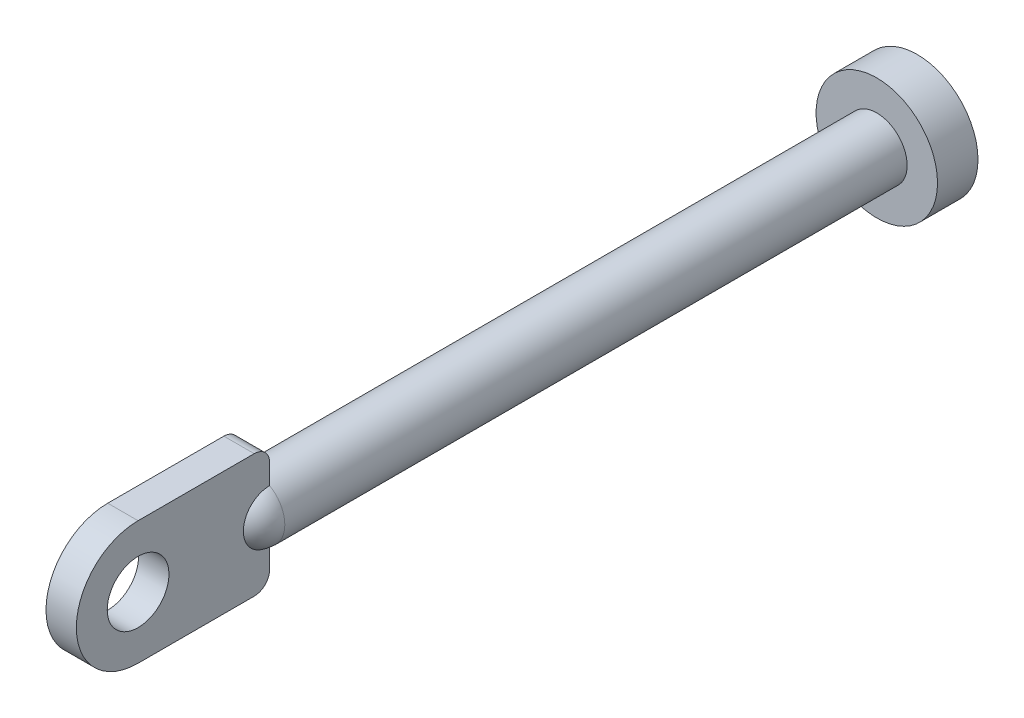
ISO-10303-21;
HEADER;
FILE_DESCRIPTION(('STEP AP214'),'2;1');
FILE_NAME('part.step','',(''),(''),'','','');
FILE_SCHEMA(('AUTOMOTIVE_DESIGN { 1 0 10303 214 1 1 1 1 }'));
ENDSEC;
DATA;
#1=APPLICATION_CONTEXT('core data for automotive mechanical design processes');
#2=APPLICATION_PROTOCOL_DEFINITION('international standard','automotive_design',2000,#1);
#3=PRODUCT_CONTEXT('',#1,'mechanical');
#4=PRODUCT('Part','Part','',(#3));
#5=PRODUCT_RELATED_PRODUCT_CATEGORY('part','',(#4));
#6=PRODUCT_DEFINITION_FORMATION('','',#4);
#7=PRODUCT_DEFINITION_CONTEXT('part definition',#1,'design');
#8=PRODUCT_DEFINITION('design','',#6,#7);
#9=PRODUCT_DEFINITION_SHAPE('','',#8);
#10=(LENGTH_UNIT() NAMED_UNIT(*) SI_UNIT(.MILLI.,.METRE.));
#11=(NAMED_UNIT(*) PLANE_ANGLE_UNIT() SI_UNIT($,.RADIAN.));
#12=(NAMED_UNIT(*) SI_UNIT($,.STERADIAN.) SOLID_ANGLE_UNIT());
#13=UNCERTAINTY_MEASURE_WITH_UNIT(LENGTH_MEASURE(1.E-05),#10,'distance_accuracy_value','');
#14=(GEOMETRIC_REPRESENTATION_CONTEXT(3) GLOBAL_UNCERTAINTY_ASSIGNED_CONTEXT((#13)) GLOBAL_UNIT_ASSIGNED_CONTEXT((#10,
#11,#12)) REPRESENTATION_CONTEXT('',''));
#15=CARTESIAN_POINT('',(0.,0.,0.));
#16=DIRECTION('',(0.,0.,1.));
#17=DIRECTION('',(1.,0.,0.));
#18=AXIS2_PLACEMENT_3D('',#15,#16,#17);
#19=CARTESIAN_POINT('',(0.,0.,40.));
#20=DIRECTION('',(0.,0.,1.));
#21=DIRECTION('',(0.,1.,0.));
#22=AXIS2_PLACEMENT_3D('',#19,#20,#21);
#23=SPHERICAL_SURFACE('',#22,3.);
#24=CARTESIAN_POINT('',(1.5,0.,40.));
#25=DIRECTION('',(-1.,0.,0.));
#26=DIRECTION('',(0.,0.,1.));
#27=AXIS2_PLACEMENT_3D('',#24,#25,#26);
#28=CIRCLE('',#27,2.59807621135332);
#29=CARTESIAN_POINT('',(1.5,-2.59807621135332,40.));
#30=VERTEX_POINT('',#29);
#31=CARTESIAN_POINT('',(1.5,2.59807621135332,40.));
#32=VERTEX_POINT('',#31);
#33=EDGE_CURVE('E24',#30,#32,#28,.T.);
#34=ORIENTED_EDGE('',*,*,#33,.F.);
#35=CARTESIAN_POINT('',(0.,0.,40.));
#36=DIRECTION('',(0.,0.,1.));
#37=DIRECTION('',(1.,0.,0.));
#38=AXIS2_PLACEMENT_3D('',#35,#36,#37);
#39=CIRCLE('',#38,3.);
#40=EDGE_CURVE('E151',#30,#32,#39,.T.);
#41=ORIENTED_EDGE('',*,*,#40,.T.);
#42=EDGE_LOOP('',(#34,#41));
#43=FACE_BOUND('',#42,.T.);
#44=ADVANCED_FACE('F15',(#43),#23,.T.);
#45=CARTESIAN_POINT('',(-1.5,2.59807621135332,40.));
#46=VERTEX_POINT('',#45);
#47=CARTESIAN_POINT('',(-1.5,-2.59807621135332,40.));
#48=VERTEX_POINT('',#47);
#49=EDGE_CURVE('E173',#46,#48,#39,.T.);
#50=ORIENTED_EDGE('',*,*,#49,.T.);
#51=CARTESIAN_POINT('',(-1.5,0.,40.));
#52=DIRECTION('',(-1.,0.,0.));
#53=DIRECTION('',(0.,0.,1.));
#54=AXIS2_PLACEMENT_3D('',#51,#52,#53);
#55=CIRCLE('',#54,2.59807621135332);
#56=EDGE_CURVE('E10',#48,#46,#55,.T.);
#57=ORIENTED_EDGE('',*,*,#56,.T.);
#58=EDGE_LOOP('',(#50,#57));
#59=FACE_BOUND('',#58,.T.);
#60=ADVANCED_FACE('F17',(#59),#23,.T.);
#61=CARTESIAN_POINT('',(0.,0.,-25.5));
#62=DIRECTION('',(0.,0.,1.));
#63=DIRECTION('',(1.,0.,0.));
#64=AXIS2_PLACEMENT_3D('',#61,#62,#63);
#65=PLANE('',#64);
#66=CARTESIAN_POINT('',(0.,0.,-25.5));
#67=DIRECTION('',(0.,0.,1.));
#68=DIRECTION('',(1.,0.,0.));
#69=AXIS2_PLACEMENT_3D('',#66,#67,#68);
#70=CIRCLE('',#69,6.);
#71=CARTESIAN_POINT('',(6.,0.,-25.5));
#72=VERTEX_POINT('',#71);
#73=EDGE_CURVE('E181',#72,#72,#70,.T.);
#74=ORIENTED_EDGE('',*,*,#73,.F.);
#75=EDGE_LOOP('',(#74));
#76=FACE_BOUND('',#75,.T.);
#77=ADVANCED_FACE('F240',(#76),#65,.F.);
#78=CARTESIAN_POINT('',(0.,0.,43.));
#79=DIRECTION('',(0.,0.,1.));
#80=DIRECTION('',(1.,0.,0.));
#81=AXIS2_PLACEMENT_3D('',#78,#79,#80);
#82=CYLINDRICAL_SURFACE('',#81,6.);
#83=ORIENTED_EDGE('',*,*,#73,.T.);
#84=EDGE_LOOP('',(#83));
#85=FACE_BOUND('',#84,.T.);
#86=CARTESIAN_POINT('',(0.,0.,-21.5));
#87=DIRECTION('',(0.,0.,1.));
#88=DIRECTION('',(1.,0.,0.));
#89=AXIS2_PLACEMENT_3D('',#86,#87,#88);
#90=CIRCLE('',#89,6.);
#91=CARTESIAN_POINT('',(6.,0.,-21.5));
#92=VERTEX_POINT('',#91);
#93=EDGE_CURVE('E177',#92,#92,#90,.T.);
#94=ORIENTED_EDGE('',*,*,#93,.F.);
#95=EDGE_LOOP('',(#94));
#96=FACE_BOUND('',#95,.T.);
#97=ADVANCED_FACE('F232',(#85,#96),#82,.T.);
#98=CARTESIAN_POINT('',(0.,3.,-21.5));
#99=DIRECTION('',(0.,0.,1.));
#100=DIRECTION('',(1.,0.,0.));
#101=AXIS2_PLACEMENT_3D('',#98,#99,#100);
#102=PLANE('',#101);
#103=ORIENTED_EDGE('',*,*,#93,.T.);
#104=EDGE_LOOP('',(#103));
#105=FACE_BOUND('',#104,.T.);
#106=CARTESIAN_POINT('',(0.,0.,-21.5));
#107=DIRECTION('',(0.,0.,1.));
#108=DIRECTION('',(1.,0.,0.));
#109=AXIS2_PLACEMENT_3D('',#106,#107,#108);
#110=CIRCLE('',#109,3.);
#111=CARTESIAN_POINT('',(3.,0.,-21.5));
#112=VERTEX_POINT('',#111);
#113=EDGE_CURVE('E172',#112,#112,#110,.T.);
#114=ORIENTED_EDGE('',*,*,#113,.F.);
#115=EDGE_LOOP('',(#114));
#116=FACE_BOUND('',#115,.T.);
#117=ADVANCED_FACE('F222',(#105,#116),#102,.T.);
#118=CARTESIAN_POINT('',(0.,0.,43.));
#119=DIRECTION('',(0.,0.,1.));
#120=DIRECTION('',(1.,0.,0.));
#121=AXIS2_PLACEMENT_3D('',#118,#119,#120);
#122=CYLINDRICAL_SURFACE('',#121,3.);
#123=ORIENTED_EDGE('',*,*,#113,.T.);
#124=EDGE_LOOP('',(#123));
#125=FACE_BOUND('',#124,.T.);
#126=EDGE_CURVE('E168',#32,#46,#39,.T.);
#127=ORIENTED_EDGE('',*,*,#126,.F.);
#128=ORIENTED_EDGE('',*,*,#40,.F.);
#129=EDGE_CURVE('E36',#48,#30,#39,.T.);
#130=ORIENTED_EDGE('',*,*,#129,.F.);
#131=ORIENTED_EDGE('',*,*,#49,.F.);
#132=EDGE_LOOP('',(#127,#128,#130,#131));
#133=FACE_BOUND('',#132,.T.);
#134=ADVANCED_FACE('F220',(#125,#133),#122,.T.);
#135=CARTESIAN_POINT('',(-1.5,-4.575,41.525));
#136=DIRECTION('',(-1.,0.,0.));
#137=DIRECTION('',(0.,0.,1.));
#138=AXIS2_PLACEMENT_3D('',#135,#136,#137);
#139=PLANE('',#138);
#140=CARTESIAN_POINT('',(-1.5,0.,53.));
#141=DIRECTION('',(-1.,0.,0.));
#142=DIRECTION('',(0.,0.,1.));
#143=AXIS2_PLACEMENT_3D('',#140,#141,#142);
#144=CIRCLE('',#143,3.05);
#145=CARTESIAN_POINT('',(-1.5,0.,56.05));
#146=VERTEX_POINT('',#145);
#147=EDGE_CURVE('E103',#146,#146,#144,.T.);
#148=ORIENTED_EDGE('',*,*,#147,.F.);
#149=EDGE_LOOP('',(#148));
#150=FACE_BOUND('',#149,.T.);
#151=ORIENTED_EDGE('',*,*,#56,.F.);
#152=DIRECTION('',(0.,1.,0.));
#153=VECTOR('',#152,1.);
#154=CARTESIAN_POINT('',(-1.5,-4.575,40.));
#155=LINE('',#154,#153);
#156=CARTESIAN_POINT('',(-1.5,-4.575,40.));
#157=VERTEX_POINT('',#156);
#158=EDGE_CURVE('E93',#157,#48,#155,.T.);
#159=ORIENTED_EDGE('',*,*,#158,.F.);
#160=CARTESIAN_POINT('',(-1.5,-4.575,41.525));
#161=DIRECTION('',(-1.,0.,0.));
#162=DIRECTION('',(0.,0.,1.));
#163=AXIS2_PLACEMENT_3D('',#160,#161,#162);
#164=CIRCLE('',#163,1.525);
#165=CARTESIAN_POINT('',(-1.5,-6.1,41.525));
#166=VERTEX_POINT('',#165);
#167=EDGE_CURVE('E86',#157,#166,#164,.T.);
#168=ORIENTED_EDGE('',*,*,#167,.T.);
#169=DIRECTION('',(0.,0.,1.));
#170=VECTOR('',#169,1.);
#171=CARTESIAN_POINT('',(-1.5,-6.1,41.525));
#172=LINE('',#171,#170);
#173=CARTESIAN_POINT('',(-1.5,-6.1,53.));
#174=VERTEX_POINT('',#173);
#175=EDGE_CURVE('E114',#166,#174,#172,.T.);
#176=ORIENTED_EDGE('',*,*,#175,.T.);
#177=CARTESIAN_POINT('',(-1.5,0.,53.));
#178=DIRECTION('',(-1.,0.,0.));
#179=DIRECTION('',(0.,0.,1.));
#180=AXIS2_PLACEMENT_3D('',#177,#178,#179);
#181=CIRCLE('',#180,6.1);
#182=CARTESIAN_POINT('',(-1.5,6.1,53.));
#183=VERTEX_POINT('',#182);
#184=EDGE_CURVE('E143',#174,#183,#181,.T.);
#185=ORIENTED_EDGE('',*,*,#184,.T.);
#186=DIRECTION('',(0.,0.,1.));
#187=VECTOR('',#186,1.);
#188=CARTESIAN_POINT('',(-1.5,6.1,41.525));
#189=LINE('',#188,#187);
#190=CARTESIAN_POINT('',(-1.5,6.1,41.525));
#191=VERTEX_POINT('',#190);
#192=EDGE_CURVE('E139',#191,#183,#189,.T.);
#193=ORIENTED_EDGE('',*,*,#192,.F.);
#194=CARTESIAN_POINT('',(-1.5,4.575,41.525));
#195=DIRECTION('',(-1.,0.,0.));
#196=DIRECTION('',(0.,0.,1.));
#197=AXIS2_PLACEMENT_3D('',#194,#195,#196);
#198=CIRCLE('',#197,1.525);
#199=CARTESIAN_POINT('',(-1.5,4.575,40.));
#200=VERTEX_POINT('',#199);
#201=EDGE_CURVE('E135',#191,#200,#198,.T.);
#202=ORIENTED_EDGE('',*,*,#201,.T.);
#203=EDGE_CURVE('E134',#46,#200,#155,.T.);
#204=ORIENTED_EDGE('',*,*,#203,.F.);
#205=EDGE_LOOP('',(#151,#159,#168,#176,#185,#193,#202,#204));
#206=FACE_BOUND('',#205,.T.);
#207=ADVANCED_FACE('F211',(#150,#206),#139,.T.);
#208=CARTESIAN_POINT('',(1.5,-4.575,41.525));
#209=DIRECTION('',(-1.,0.,0.));
#210=DIRECTION('',(0.,0.,1.));
#211=AXIS2_PLACEMENT_3D('',#208,#209,#210);
#212=PLANE('',#211);
#213=CARTESIAN_POINT('',(1.5,0.,53.));
#214=DIRECTION('',(-1.,0.,0.));
#215=DIRECTION('',(0.,0.,1.));
#216=AXIS2_PLACEMENT_3D('',#213,#214,#215);
#217=CIRCLE('',#216,3.05);
#218=CARTESIAN_POINT('',(1.5,0.,56.05));
#219=VERTEX_POINT('',#218);
#220=EDGE_CURVE('E165',#219,#219,#217,.T.);
#221=ORIENTED_EDGE('',*,*,#220,.T.);
#222=EDGE_LOOP('',(#221));
#223=FACE_BOUND('',#222,.T.);
#224=DIRECTION('',(0.,1.,0.));
#225=VECTOR('',#224,1.);
#226=CARTESIAN_POINT('',(1.5,-4.575,40.));
#227=LINE('',#226,#225);
#228=CARTESIAN_POINT('',(1.5,-4.575,40.));
#229=VERTEX_POINT('',#228);
#230=EDGE_CURVE('E98',#229,#30,#227,.T.);
#231=ORIENTED_EDGE('',*,*,#230,.T.);
#232=ORIENTED_EDGE('',*,*,#33,.T.);
#233=CARTESIAN_POINT('',(1.5,4.575,40.));
#234=VERTEX_POINT('',#233);
#235=EDGE_CURVE('E107',#32,#234,#227,.T.);
#236=ORIENTED_EDGE('',*,*,#235,.T.);
#237=CARTESIAN_POINT('',(1.5,4.575,41.525));
#238=DIRECTION('',(-1.,0.,0.));
#239=DIRECTION('',(0.,0.,1.));
#240=AXIS2_PLACEMENT_3D('',#237,#238,#239);
#241=CIRCLE('',#240,1.525);
#242=CARTESIAN_POINT('',(1.5,6.1,41.525));
#243=VERTEX_POINT('',#242);
#244=EDGE_CURVE('E116',#243,#234,#241,.T.);
#245=ORIENTED_EDGE('',*,*,#244,.F.);
#246=DIRECTION('',(0.,0.,1.));
#247=VECTOR('',#246,1.);
#248=CARTESIAN_POINT('',(1.5,6.1,41.525));
#249=LINE('',#248,#247);
#250=CARTESIAN_POINT('',(1.5,6.1,53.));
#251=VERTEX_POINT('',#250);
#252=EDGE_CURVE('E122',#243,#251,#249,.T.);
#253=ORIENTED_EDGE('',*,*,#252,.T.);
#254=CARTESIAN_POINT('',(1.5,0.,53.));
#255=DIRECTION('',(-1.,0.,0.));
#256=DIRECTION('',(0.,0.,1.));
#257=AXIS2_PLACEMENT_3D('',#254,#255,#256);
#258=CIRCLE('',#257,6.1);
#259=CARTESIAN_POINT('',(1.5,-6.1,53.));
#260=VERTEX_POINT('',#259);
#261=EDGE_CURVE('E126',#260,#251,#258,.T.);
#262=ORIENTED_EDGE('',*,*,#261,.F.);
#263=DIRECTION('',(0.,0.,1.));
#264=VECTOR('',#263,1.);
#265=CARTESIAN_POINT('',(1.5,-6.1,41.525));
#266=LINE('',#265,#264);
#267=CARTESIAN_POINT('',(1.5,-6.1,41.525));
#268=VERTEX_POINT('',#267);
#269=EDGE_CURVE('E100',#268,#260,#266,.T.);
#270=ORIENTED_EDGE('',*,*,#269,.F.);
#271=CARTESIAN_POINT('',(1.5,-4.575,41.525));
#272=DIRECTION('',(-1.,0.,0.));
#273=DIRECTION('',(0.,0.,1.));
#274=AXIS2_PLACEMENT_3D('',#271,#272,#273);
#275=CIRCLE('',#274,1.525);
#276=EDGE_CURVE('E84',#229,#268,#275,.T.);
#277=ORIENTED_EDGE('',*,*,#276,.F.);
#278=EDGE_LOOP('',(#231,#232,#236,#245,#253,#262,#270,#277));
#279=FACE_BOUND('',#278,.T.);
#280=ADVANCED_FACE('F97',(#223,#279),#212,.F.);
#281=CARTESIAN_POINT('',(-1.5,-4.575,40.));
#282=DIRECTION('',(0.,0.,-1.));
#283=DIRECTION('',(0.,-1.,0.));
#284=AXIS2_PLACEMENT_3D('',#281,#282,#283);
#285=PLANE('',#284);
#286=ORIENTED_EDGE('',*,*,#158,.T.);
#287=ORIENTED_EDGE('',*,*,#129,.T.);
#288=ORIENTED_EDGE('',*,*,#230,.F.);
#289=DIRECTION('',(1.,0.,0.));
#290=VECTOR('',#289,1.);
#291=CARTESIAN_POINT('',(-1.5,-4.575,40.));
#292=LINE('',#291,#290);
#293=EDGE_CURVE('E80',#157,#229,#292,.T.);
#294=ORIENTED_EDGE('',*,*,#293,.F.);
#295=EDGE_LOOP('',(#286,#287,#288,#294));
#296=FACE_BOUND('',#295,.T.);
#297=ADVANCED_FACE('F105',(#296),#285,.T.);
#298=CARTESIAN_POINT('',(-1.5,-4.575,41.525));
#299=DIRECTION('',(1.,0.,0.));
#300=DIRECTION('',(0.,0.,-1.));
#301=AXIS2_PLACEMENT_3D('',#298,#299,#300);
#302=CYLINDRICAL_SURFACE('',#301,1.525);
#303=ORIENTED_EDGE('',*,*,#276,.T.);
#304=DIRECTION('',(1.,0.,0.));
#305=VECTOR('',#304,1.);
#306=CARTESIAN_POINT('',(-1.5,-6.1,41.525));
#307=LINE('',#306,#305);
#308=EDGE_CURVE('E148',#166,#268,#307,.T.);
#309=ORIENTED_EDGE('',*,*,#308,.F.);
#310=ORIENTED_EDGE('',*,*,#167,.F.);
#311=ORIENTED_EDGE('',*,*,#293,.T.);
#312=EDGE_LOOP('',(#303,#309,#310,#311));
#313=FACE_BOUND('',#312,.T.);
#314=ADVANCED_FACE('F82',(#313),#302,.T.);
#315=CARTESIAN_POINT('',(-1.5,-6.1,41.525));
#316=DIRECTION('',(0.,1.,0.));
#317=DIRECTION('',(0.,0.,-1.));
#318=AXIS2_PLACEMENT_3D('',#315,#316,#317);
#319=PLANE('',#318);
#320=ORIENTED_EDGE('',*,*,#269,.T.);
#321=DIRECTION('',(1.,0.,0.));
#322=VECTOR('',#321,1.);
#323=CARTESIAN_POINT('',(-1.5,-6.1,53.));
#324=LINE('',#323,#322);
#325=EDGE_CURVE('E152',#174,#260,#324,.T.);
#326=ORIENTED_EDGE('',*,*,#325,.F.);
#327=ORIENTED_EDGE('',*,*,#175,.F.);
#328=ORIENTED_EDGE('',*,*,#308,.T.);
#329=EDGE_LOOP('',(#320,#326,#327,#328));
#330=FACE_BOUND('',#329,.T.);
#331=ADVANCED_FACE('F208',(#330),#319,.F.);
#332=CARTESIAN_POINT('',(-1.5,0.,53.));
#333=DIRECTION('',(1.,0.,0.));
#334=DIRECTION('',(0.,0.,-1.));
#335=AXIS2_PLACEMENT_3D('',#332,#333,#334);
#336=CYLINDRICAL_SURFACE('',#335,6.1);
#337=ORIENTED_EDGE('',*,*,#261,.T.);
#338=DIRECTION('',(1.,0.,0.));
#339=VECTOR('',#338,1.);
#340=CARTESIAN_POINT('',(-1.5,6.1,53.));
#341=LINE('',#340,#339);
#342=EDGE_CURVE('E156',#183,#251,#341,.T.);
#343=ORIENTED_EDGE('',*,*,#342,.F.);
#344=ORIENTED_EDGE('',*,*,#184,.F.);
#345=ORIENTED_EDGE('',*,*,#325,.T.);
#346=EDGE_LOOP('',(#337,#343,#344,#345));
#347=FACE_BOUND('',#346,.T.);
#348=ADVANCED_FACE('F205',(#347),#336,.T.);
#349=CARTESIAN_POINT('',(-1.5,6.1,41.525));
#350=DIRECTION('',(0.,1.,0.));
#351=DIRECTION('',(0.,0.,-1.));
#352=AXIS2_PLACEMENT_3D('',#349,#350,#351);
#353=PLANE('',#352);
#354=ORIENTED_EDGE('',*,*,#252,.F.);
#355=DIRECTION('',(1.,0.,0.));
#356=VECTOR('',#355,1.);
#357=CARTESIAN_POINT('',(-1.5,6.1,41.525));
#358=LINE('',#357,#356);
#359=EDGE_CURVE('E159',#191,#243,#358,.T.);
#360=ORIENTED_EDGE('',*,*,#359,.F.);
#361=ORIENTED_EDGE('',*,*,#192,.T.);
#362=ORIENTED_EDGE('',*,*,#342,.T.);
#363=EDGE_LOOP('',(#354,#360,#361,#362));
#364=FACE_BOUND('',#363,.T.);
#365=ADVANCED_FACE('F200',(#364),#353,.T.);
#366=CARTESIAN_POINT('',(-1.5,4.575,41.525));
#367=DIRECTION('',(1.,0.,0.));
#368=DIRECTION('',(0.,0.,-1.));
#369=AXIS2_PLACEMENT_3D('',#366,#367,#368);
#370=CYLINDRICAL_SURFACE('',#369,1.525);
#371=ORIENTED_EDGE('',*,*,#244,.T.);
#372=DIRECTION('',(1.,0.,0.));
#373=VECTOR('',#372,1.);
#374=CARTESIAN_POINT('',(-1.5,4.575,40.));
#375=LINE('',#374,#373);
#376=EDGE_CURVE('E92',#200,#234,#375,.T.);
#377=ORIENTED_EDGE('',*,*,#376,.F.);
#378=ORIENTED_EDGE('',*,*,#201,.F.);
#379=ORIENTED_EDGE('',*,*,#359,.T.);
#380=EDGE_LOOP('',(#371,#377,#378,#379));
#381=FACE_BOUND('',#380,.T.);
#382=ADVANCED_FACE('F197',(#381),#370,.T.);
#383=ORIENTED_EDGE('',*,*,#235,.F.);
#384=ORIENTED_EDGE('',*,*,#126,.T.);
#385=ORIENTED_EDGE('',*,*,#203,.T.);
#386=ORIENTED_EDGE('',*,*,#376,.T.);
#387=EDGE_LOOP('',(#383,#384,#385,#386));
#388=FACE_BOUND('',#387,.T.);
#389=ADVANCED_FACE('F191',(#388),#285,.T.);
#390=CARTESIAN_POINT('',(2.5,0.,53.));
#391=DIRECTION('',(-1.,0.,0.));
#392=DIRECTION('',(0.,1.,0.));
#393=AXIS2_PLACEMENT_3D('',#390,#391,#392);
#394=CYLINDRICAL_SURFACE('',#393,3.05);
#395=ORIENTED_EDGE('',*,*,#147,.T.);
#396=EDGE_LOOP('',(#395));
#397=FACE_BOUND('',#396,.T.);
#398=ORIENTED_EDGE('',*,*,#220,.F.);
#399=EDGE_LOOP('',(#398));
#400=FACE_BOUND('',#399,.T.);
#401=ADVANCED_FACE('F350',(#397,#400),#394,.F.);
#402=CLOSED_SHELL('',(#44,#60,#77,#97,#117,#134,#207,#280,#297,#314,#331,#348,#365,#382,#389,#401));
#403=MANIFOLD_SOLID_BREP('B1',#402);
#404=ADVANCED_BREP_SHAPE_REPRESENTATION('',(#18,#403),#14);
#405=SHAPE_DEFINITION_REPRESENTATION(#9,#404);
ENDSEC;
END-ISO-10303-21;
